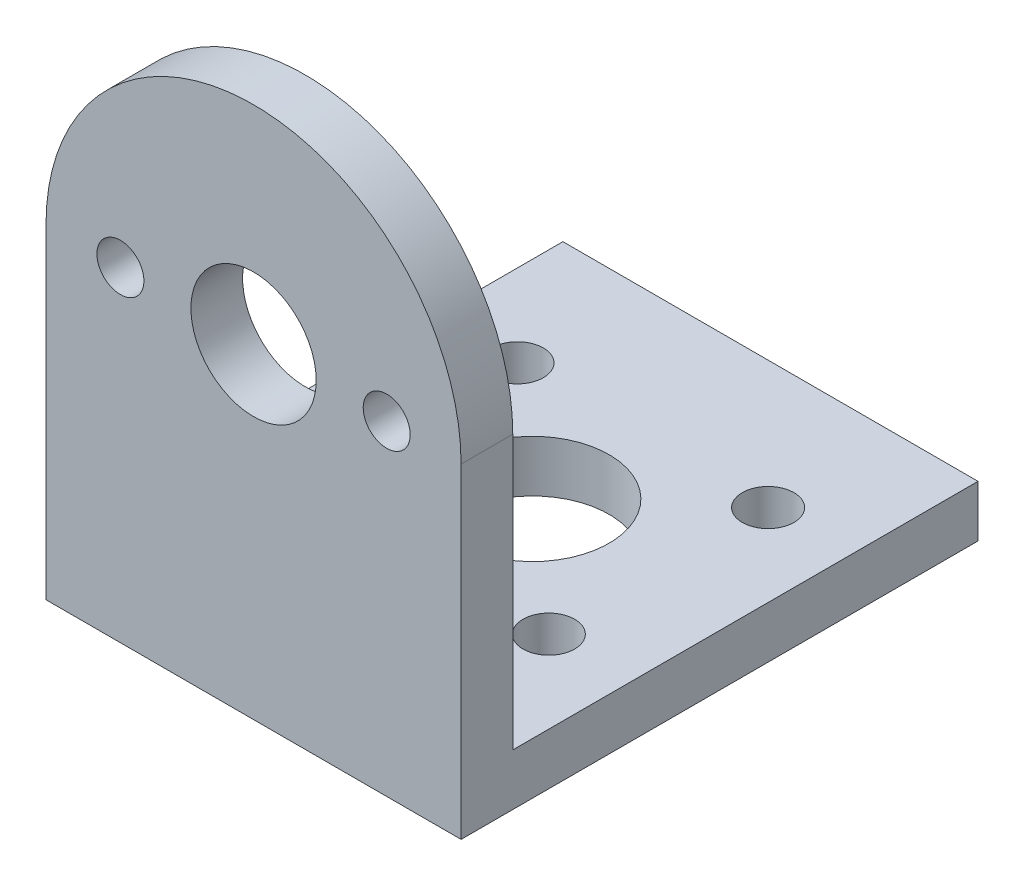
ISO-10303-21;
HEADER;
FILE_DESCRIPTION(('STEP AP214'),'2;1');
FILE_NAME('part.step','',(''),(''),'','','');
FILE_SCHEMA(('AUTOMOTIVE_DESIGN { 1 0 10303 214 1 1 1 1 }'));
ENDSEC;
DATA;
#1=APPLICATION_CONTEXT('core data for automotive mechanical design processes');
#2=APPLICATION_PROTOCOL_DEFINITION('international standard','automotive_design',2000,#1);
#3=PRODUCT_CONTEXT('',#1,'mechanical');
#4=PRODUCT('Part','Part','',(#3));
#5=PRODUCT_RELATED_PRODUCT_CATEGORY('part','',(#4));
#6=PRODUCT_DEFINITION_FORMATION('','',#4);
#7=PRODUCT_DEFINITION_CONTEXT('part definition',#1,'design');
#8=PRODUCT_DEFINITION('design','',#6,#7);
#9=PRODUCT_DEFINITION_SHAPE('','',#8);
#10=(LENGTH_UNIT() NAMED_UNIT(*) SI_UNIT(.MILLI.,.METRE.));
#11=(NAMED_UNIT(*) PLANE_ANGLE_UNIT() SI_UNIT($,.RADIAN.));
#12=(NAMED_UNIT(*) SI_UNIT($,.STERADIAN.) SOLID_ANGLE_UNIT());
#13=UNCERTAINTY_MEASURE_WITH_UNIT(LENGTH_MEASURE(1.E-05),#10,'distance_accuracy_value','');
#14=(GEOMETRIC_REPRESENTATION_CONTEXT(3) GLOBAL_UNCERTAINTY_ASSIGNED_CONTEXT((#13)) GLOBAL_UNIT_ASSIGNED_CONTEXT((#10,
#11,#12)) REPRESENTATION_CONTEXT('',''));
#15=CARTESIAN_POINT('',(0.,0.,0.));
#16=DIRECTION('',(0.,0.,1.));
#17=DIRECTION('',(1.,0.,0.));
#18=AXIS2_PLACEMENT_3D('',#15,#16,#17);
#19=CARTESIAN_POINT('',(0.,0.,0.));
#20=DIRECTION('',(0.,0.,-1.));
#21=DIRECTION('',(-1.,0.,0.));
#22=AXIS2_PLACEMENT_3D('',#19,#20,#21);
#23=PLANE('',#22);
#24=CARTESIAN_POINT('',(-8.5,0.,0.));
#25=DIRECTION('',(0.,0.,1.));
#26=DIRECTION('',(1.,0.,0.));
#27=AXIS2_PLACEMENT_3D('',#24,#25,#26);
#28=CIRCLE('',#27,1.5);
#29=CARTESIAN_POINT('',(-7.,0.,0.));
#30=VERTEX_POINT('',#29);
#31=EDGE_CURVE('E129',#30,#30,#28,.T.);
#32=ORIENTED_EDGE('',*,*,#31,.T.);
#33=EDGE_LOOP('',(#32));
#34=FACE_BOUND('',#33,.T.);
#35=CARTESIAN_POINT('',(0.,0.,0.));
#36=DIRECTION('',(0.,0.,1.));
#37=DIRECTION('',(1.,0.,0.));
#38=AXIS2_PLACEMENT_3D('',#35,#36,#37);
#39=CIRCLE('',#38,4.);
#40=CARTESIAN_POINT('',(4.,0.,0.));
#41=VERTEX_POINT('',#40);
#42=EDGE_CURVE('E135',#41,#41,#39,.T.);
#43=ORIENTED_EDGE('',*,*,#42,.T.);
#44=EDGE_LOOP('',(#43));
#45=FACE_BOUND('',#44,.T.);
#46=CARTESIAN_POINT('',(8.5,0.,0.));
#47=DIRECTION('',(0.,0.,1.));
#48=DIRECTION('',(-1.,0.,0.));
#49=AXIS2_PLACEMENT_3D('',#46,#47,#48);
#50=CIRCLE('',#49,1.5);
#51=CARTESIAN_POINT('',(7.,0.,0.));
#52=VERTEX_POINT('',#51);
#53=EDGE_CURVE('E124',#52,#52,#50,.T.);
#54=ORIENTED_EDGE('',*,*,#53,.T.);
#55=EDGE_LOOP('',(#54));
#56=FACE_BOUND('',#55,.T.);
#57=DIRECTION('',(0.,1.,0.));
#58=VECTOR('',#57,1.);
#59=CARTESIAN_POINT('',(13.25,0.,0.));
#60=LINE('',#59,#58);
#61=CARTESIAN_POINT('',(13.25,-17.45,0.));
#62=VERTEX_POINT('',#61);
#63=CARTESIAN_POINT('',(13.25,0.,0.));
#64=VERTEX_POINT('',#63);
#65=EDGE_CURVE('E75',#62,#64,#60,.T.);
#66=ORIENTED_EDGE('',*,*,#65,.F.);
#67=DIRECTION('',(-1.,0.,0.));
#68=VECTOR('',#67,1.);
#69=CARTESIAN_POINT('',(13.25,-17.45,0.));
#70=LINE('',#69,#68);
#71=CARTESIAN_POINT('',(-13.25,-17.45,0.));
#72=VERTEX_POINT('',#71);
#73=EDGE_CURVE('E99',#62,#72,#70,.T.);
#74=ORIENTED_EDGE('',*,*,#73,.T.);
#75=DIRECTION('',(0.,-1.,0.));
#76=VECTOR('',#75,1.);
#77=CARTESIAN_POINT('',(-13.25,0.,0.));
#78=LINE('',#77,#76);
#79=CARTESIAN_POINT('',(-13.25,0.,0.));
#80=VERTEX_POINT('',#79);
#81=EDGE_CURVE('E153',#80,#72,#78,.T.);
#82=ORIENTED_EDGE('',*,*,#81,.F.);
#83=CARTESIAN_POINT('',(0.,0.,0.));
#84=DIRECTION('',(0.,0.,1.));
#85=DIRECTION('',(-1.,0.,0.));
#86=AXIS2_PLACEMENT_3D('',#83,#84,#85);
#87=CIRCLE('',#86,13.25);
#88=EDGE_CURVE('E141',#64,#80,#87,.T.);
#89=ORIENTED_EDGE('',*,*,#88,.F.);
#90=EDGE_LOOP('',(#66,#74,#82,#89));
#91=FACE_BOUND('',#90,.T.);
#92=ADVANCED_FACE('F36',(#34,#45,#56,#91),#23,.T.);
#93=CARTESIAN_POINT('',(0.,0.,3.3));
#94=DIRECTION('',(0.,0.,-1.));
#95=DIRECTION('',(-1.,0.,0.));
#96=AXIS2_PLACEMENT_3D('',#93,#94,#95);
#97=PLANE('',#96);
#98=CARTESIAN_POINT('',(0.,0.,3.3));
#99=DIRECTION('',(0.,0.,1.));
#100=DIRECTION('',(-1.,0.,0.));
#101=AXIS2_PLACEMENT_3D('',#98,#99,#100);
#102=CIRCLE('',#101,13.25);
#103=CARTESIAN_POINT('',(13.25,0.,3.3));
#104=VERTEX_POINT('',#103);
#105=CARTESIAN_POINT('',(-13.25,0.,3.3));
#106=VERTEX_POINT('',#105);
#107=EDGE_CURVE('E144',#104,#106,#102,.T.);
#108=ORIENTED_EDGE('',*,*,#107,.T.);
#109=DIRECTION('',(0.,-1.,0.));
#110=VECTOR('',#109,1.);
#111=CARTESIAN_POINT('',(-13.25,0.,3.3));
#112=LINE('',#111,#110);
#113=CARTESIAN_POINT('',(-13.25,-20.75,3.3));
#114=VERTEX_POINT('',#113);
#115=EDGE_CURVE('E82',#106,#114,#112,.T.);
#116=ORIENTED_EDGE('',*,*,#115,.T.);
#117=DIRECTION('',(1.,0.,0.));
#118=VECTOR('',#117,1.);
#119=CARTESIAN_POINT('',(-13.25,-20.75,3.3));
#120=LINE('',#119,#118);
#121=CARTESIAN_POINT('',(13.25,-20.75,3.3));
#122=VERTEX_POINT('',#121);
#123=EDGE_CURVE('E147',#114,#122,#120,.T.);
#124=ORIENTED_EDGE('',*,*,#123,.T.);
#125=DIRECTION('',(0.,1.,0.));
#126=VECTOR('',#125,1.);
#127=CARTESIAN_POINT('',(13.25,0.,3.3));
#128=LINE('',#127,#126);
#129=EDGE_CURVE('E60',#122,#104,#128,.T.);
#130=ORIENTED_EDGE('',*,*,#129,.T.);
#131=EDGE_LOOP('',(#108,#116,#124,#130));
#132=FACE_BOUND('',#131,.T.);
#133=CARTESIAN_POINT('',(0.,0.,3.3));
#134=DIRECTION('',(0.,0.,1.));
#135=DIRECTION('',(1.,0.,0.));
#136=AXIS2_PLACEMENT_3D('',#133,#134,#135);
#137=CIRCLE('',#136,4.);
#138=CARTESIAN_POINT('',(4.,0.,3.3));
#139=VERTEX_POINT('',#138);
#140=EDGE_CURVE('E138',#139,#139,#137,.T.);
#141=ORIENTED_EDGE('',*,*,#140,.F.);
#142=EDGE_LOOP('',(#141));
#143=FACE_BOUND('',#142,.T.);
#144=CARTESIAN_POINT('',(-8.5,0.,3.3));
#145=DIRECTION('',(0.,0.,1.));
#146=DIRECTION('',(1.,0.,0.));
#147=AXIS2_PLACEMENT_3D('',#144,#145,#146);
#148=CIRCLE('',#147,1.5);
#149=CARTESIAN_POINT('',(-7.,0.,3.3));
#150=VERTEX_POINT('',#149);
#151=EDGE_CURVE('E132',#150,#150,#148,.T.);
#152=ORIENTED_EDGE('',*,*,#151,.F.);
#153=EDGE_LOOP('',(#152));
#154=FACE_BOUND('',#153,.T.);
#155=CARTESIAN_POINT('',(8.5,0.,3.3));
#156=DIRECTION('',(0.,0.,1.));
#157=DIRECTION('',(-1.,0.,0.));
#158=AXIS2_PLACEMENT_3D('',#155,#156,#157);
#159=CIRCLE('',#158,1.5);
#160=CARTESIAN_POINT('',(7.,0.,3.3));
#161=VERTEX_POINT('',#160);
#162=EDGE_CURVE('E126',#161,#161,#159,.T.);
#163=ORIENTED_EDGE('',*,*,#162,.F.);
#164=EDGE_LOOP('',(#163));
#165=FACE_BOUND('',#164,.T.);
#166=ADVANCED_FACE('F167',(#132,#143,#154,#165),#97,.F.);
#167=CARTESIAN_POINT('',(0.,0.,3.3));
#168=DIRECTION('',(0.,0.,-1.));
#169=DIRECTION('',(-1.,0.,0.));
#170=AXIS2_PLACEMENT_3D('',#167,#168,#169);
#171=CYLINDRICAL_SURFACE('',#170,13.25);
#172=ORIENTED_EDGE('',*,*,#88,.T.);
#173=DIRECTION('',(0.,0.,-1.));
#174=VECTOR('',#173,1.);
#175=CARTESIAN_POINT('',(-13.25,0.,3.3));
#176=LINE('',#175,#174);
#177=EDGE_CURVE('E11',#106,#80,#176,.T.);
#178=ORIENTED_EDGE('',*,*,#177,.F.);
#179=ORIENTED_EDGE('',*,*,#107,.F.);
#180=DIRECTION('',(0.,0.,-1.));
#181=VECTOR('',#180,1.);
#182=CARTESIAN_POINT('',(13.25,0.,3.3));
#183=LINE('',#182,#181);
#184=EDGE_CURVE('E150',#104,#64,#183,.T.);
#185=ORIENTED_EDGE('',*,*,#184,.T.);
#186=EDGE_LOOP('',(#172,#178,#179,#185));
#187=FACE_BOUND('',#186,.T.);
#188=ADVANCED_FACE('F38',(#187),#171,.T.);
#189=CARTESIAN_POINT('',(-13.25,0.,3.3));
#190=DIRECTION('',(1.,0.,0.));
#191=DIRECTION('',(0.,1.,0.));
#192=AXIS2_PLACEMENT_3D('',#189,#190,#191);
#193=PLANE('',#192);
#194=ORIENTED_EDGE('',*,*,#81,.T.);
#195=DIRECTION('',(0.,0.,1.));
#196=VECTOR('',#195,1.);
#197=CARTESIAN_POINT('',(-13.25,-17.45,-29.7));
#198=LINE('',#197,#196);
#199=CARTESIAN_POINT('',(-13.25,-17.45,-29.7));
#200=VERTEX_POINT('',#199);
#201=EDGE_CURVE('E51',#200,#72,#198,.T.);
#202=ORIENTED_EDGE('',*,*,#201,.F.);
#203=DIRECTION('',(0.,-1.,0.));
#204=VECTOR('',#203,1.);
#205=CARTESIAN_POINT('',(-13.25,-20.75,-29.7));
#206=LINE('',#205,#204);
#207=CARTESIAN_POINT('',(-13.25,-20.75,-29.7));
#208=VERTEX_POINT('',#207);
#209=EDGE_CURVE('E111',#200,#208,#206,.T.);
#210=ORIENTED_EDGE('',*,*,#209,.T.);
#211=DIRECTION('',(0.,0.,-1.));
#212=VECTOR('',#211,1.);
#213=CARTESIAN_POINT('',(-13.25,-20.75,3.3));
#214=LINE('',#213,#212);
#215=EDGE_CURVE('E44',#114,#208,#214,.T.);
#216=ORIENTED_EDGE('',*,*,#215,.F.);
#217=ORIENTED_EDGE('',*,*,#115,.F.);
#218=ORIENTED_EDGE('',*,*,#177,.T.);
#219=EDGE_LOOP('',(#194,#202,#210,#216,#217,#218));
#220=FACE_BOUND('',#219,.T.);
#221=ADVANCED_FACE('F161',(#220),#193,.F.);
#222=CARTESIAN_POINT('',(-13.25,-20.75,3.3));
#223=DIRECTION('',(0.,1.,0.));
#224=DIRECTION('',(0.,0.,1.));
#225=AXIS2_PLACEMENT_3D('',#222,#223,#224);
#226=PLANE('',#225);
#227=CARTESIAN_POINT('',(8.,-20.75,-21.55));
#228=DIRECTION('',(0.,1.,0.));
#229=DIRECTION('',(0.,0.,1.));
#230=AXIS2_PLACEMENT_3D('',#227,#228,#229);
#231=CIRCLE('',#230,1.65);
#232=CARTESIAN_POINT('',(8.,-20.75,-19.9));
#233=VERTEX_POINT('',#232);
#234=EDGE_CURVE('E332',#233,#233,#231,.F.);
#235=ORIENTED_EDGE('',*,*,#234,.F.);
#236=EDGE_LOOP('',(#235));
#237=FACE_BOUND('',#236,.T.);
#238=CARTESIAN_POINT('',(8.,-20.75,-7.55));
#239=DIRECTION('',(0.,1.,0.));
#240=DIRECTION('',(0.,0.,1.));
#241=AXIS2_PLACEMENT_3D('',#238,#239,#240);
#242=CIRCLE('',#241,1.65);
#243=CARTESIAN_POINT('',(8.,-20.75,-5.9));
#244=VERTEX_POINT('',#243);
#245=EDGE_CURVE('E340',#244,#244,#242,.F.);
#246=ORIENTED_EDGE('',*,*,#245,.F.);
#247=EDGE_LOOP('',(#246));
#248=FACE_BOUND('',#247,.T.);
#249=CARTESIAN_POINT('',(-7.99999999999999,-20.75,-7.55));
#250=DIRECTION('',(0.,1.,0.));
#251=DIRECTION('',(0.,0.,1.));
#252=AXIS2_PLACEMENT_3D('',#249,#250,#251);
#253=CIRCLE('',#252,1.65);
#254=CARTESIAN_POINT('',(-7.99999999999999,-20.75,-5.9));
#255=VERTEX_POINT('',#254);
#256=EDGE_CURVE('E353',#255,#255,#253,.F.);
#257=ORIENTED_EDGE('',*,*,#256,.F.);
#258=EDGE_LOOP('',(#257));
#259=FACE_BOUND('',#258,.T.);
#260=CARTESIAN_POINT('',(-8.,-20.75,-21.55));
#261=DIRECTION('',(0.,1.,0.));
#262=DIRECTION('',(0.,0.,1.));
#263=AXIS2_PLACEMENT_3D('',#260,#261,#262);
#264=CIRCLE('',#263,1.65);
#265=CARTESIAN_POINT('',(-8.,-20.75,-19.9));
#266=VERTEX_POINT('',#265);
#267=EDGE_CURVE('E344',#266,#266,#264,.F.);
#268=ORIENTED_EDGE('',*,*,#267,.F.);
#269=EDGE_LOOP('',(#268));
#270=FACE_BOUND('',#269,.T.);
#271=CARTESIAN_POINT('',(0.,-20.75,-14.5));
#272=DIRECTION('',(0.,1.,0.));
#273=DIRECTION('',(0.,0.,1.));
#274=AXIS2_PLACEMENT_3D('',#271,#272,#273);
#275=CIRCLE('',#274,4.9);
#276=CARTESIAN_POINT('',(0.,-20.75,-9.6));
#277=VERTEX_POINT('',#276);
#278=EDGE_CURVE('E117',#277,#277,#275,.F.);
#279=ORIENTED_EDGE('',*,*,#278,.F.);
#280=EDGE_LOOP('',(#279));
#281=FACE_BOUND('',#280,.T.);
#282=ORIENTED_EDGE('',*,*,#215,.T.);
#283=DIRECTION('',(1.,0.,0.));
#284=VECTOR('',#283,1.);
#285=CARTESIAN_POINT('',(13.25,-20.75,-29.7));
#286=LINE('',#285,#284);
#287=CARTESIAN_POINT('',(13.25,-20.75,-29.7));
#288=VERTEX_POINT('',#287);
#289=EDGE_CURVE('E101',#208,#288,#286,.T.);
#290=ORIENTED_EDGE('',*,*,#289,.T.);
#291=DIRECTION('',(0.,0.,-1.));
#292=VECTOR('',#291,1.);
#293=CARTESIAN_POINT('',(13.25,-20.75,3.3));
#294=LINE('',#293,#292);
#295=EDGE_CURVE('E115',#122,#288,#294,.T.);
#296=ORIENTED_EDGE('',*,*,#295,.F.);
#297=ORIENTED_EDGE('',*,*,#123,.F.);
#298=EDGE_LOOP('',(#282,#290,#296,#297));
#299=FACE_BOUND('',#298,.T.);
#300=ADVANCED_FACE('F160',(#237,#248,#259,#270,#281,#299),#226,.F.);
#301=CARTESIAN_POINT('',(13.25,0.,3.3));
#302=DIRECTION('',(-1.,0.,0.));
#303=DIRECTION('',(0.,-1.,0.));
#304=AXIS2_PLACEMENT_3D('',#301,#302,#303);
#305=PLANE('',#304);
#306=ORIENTED_EDGE('',*,*,#295,.T.);
#307=DIRECTION('',(0.,1.,0.));
#308=VECTOR('',#307,1.);
#309=CARTESIAN_POINT('',(13.25,-20.75,-29.7));
#310=LINE('',#309,#308);
#311=CARTESIAN_POINT('',(13.25,-17.45,-29.7));
#312=VERTEX_POINT('',#311);
#313=EDGE_CURVE('E108',#288,#312,#310,.T.);
#314=ORIENTED_EDGE('',*,*,#313,.T.);
#315=DIRECTION('',(0.,0.,1.));
#316=VECTOR('',#315,1.);
#317=CARTESIAN_POINT('',(13.25,-17.45,-29.7));
#318=LINE('',#317,#316);
#319=EDGE_CURVE('E95',#312,#62,#318,.T.);
#320=ORIENTED_EDGE('',*,*,#319,.T.);
#321=ORIENTED_EDGE('',*,*,#65,.T.);
#322=ORIENTED_EDGE('',*,*,#184,.F.);
#323=ORIENTED_EDGE('',*,*,#129,.F.);
#324=EDGE_LOOP('',(#306,#314,#320,#321,#322,#323));
#325=FACE_BOUND('',#324,.T.);
#326=ADVANCED_FACE('F113',(#325),#305,.F.);
#327=CARTESIAN_POINT('',(0.,0.,3.3));
#328=DIRECTION('',(0.,0.,-1.));
#329=DIRECTION('',(-1.,0.,0.));
#330=AXIS2_PLACEMENT_3D('',#327,#328,#329);
#331=CYLINDRICAL_SURFACE('',#330,4.);
#332=ORIENTED_EDGE('',*,*,#140,.T.);
#333=EDGE_LOOP('',(#332));
#334=FACE_BOUND('',#333,.T.);
#335=ORIENTED_EDGE('',*,*,#42,.F.);
#336=EDGE_LOOP('',(#335));
#337=FACE_BOUND('',#336,.T.);
#338=ADVANCED_FACE('F194',(#334,#337),#331,.F.);
#339=CARTESIAN_POINT('',(-8.5,0.,3.3));
#340=DIRECTION('',(0.,0.,-1.));
#341=DIRECTION('',(-1.,0.,0.));
#342=AXIS2_PLACEMENT_3D('',#339,#340,#341);
#343=CYLINDRICAL_SURFACE('',#342,1.5);
#344=ORIENTED_EDGE('',*,*,#151,.T.);
#345=EDGE_LOOP('',(#344));
#346=FACE_BOUND('',#345,.T.);
#347=ORIENTED_EDGE('',*,*,#31,.F.);
#348=EDGE_LOOP('',(#347));
#349=FACE_BOUND('',#348,.T.);
#350=ADVANCED_FACE('F180',(#346,#349),#343,.F.);
#351=CARTESIAN_POINT('',(8.5,0.,3.3));
#352=DIRECTION('',(0.,0.,-1.));
#353=DIRECTION('',(-1.,0.,0.));
#354=AXIS2_PLACEMENT_3D('',#351,#352,#353);
#355=CYLINDRICAL_SURFACE('',#354,1.5);
#356=ORIENTED_EDGE('',*,*,#162,.T.);
#357=EDGE_LOOP('',(#356));
#358=FACE_BOUND('',#357,.T.);
#359=ORIENTED_EDGE('',*,*,#53,.F.);
#360=EDGE_LOOP('',(#359));
#361=FACE_BOUND('',#360,.T.);
#362=ADVANCED_FACE('F177',(#358,#361),#355,.F.);
#363=CARTESIAN_POINT('',(13.25,-17.45,-29.7));
#364=DIRECTION('',(0.,1.,0.));
#365=DIRECTION('',(-1.,0.,0.));
#366=AXIS2_PLACEMENT_3D('',#363,#364,#365);
#367=PLANE('',#366);
#368=CARTESIAN_POINT('',(8.,-17.45,-21.55));
#369=DIRECTION('',(0.,1.,0.));
#370=DIRECTION('',(1.,0.,0.));
#371=AXIS2_PLACEMENT_3D('',#368,#369,#370);
#372=CIRCLE('',#371,1.65);
#373=CARTESIAN_POINT('',(9.65,-17.45,-21.55));
#374=VERTEX_POINT('',#373);
#375=EDGE_CURVE('E335',#374,#374,#372,.T.);
#376=ORIENTED_EDGE('',*,*,#375,.F.);
#377=EDGE_LOOP('',(#376));
#378=FACE_BOUND('',#377,.T.);
#379=CARTESIAN_POINT('',(8.,-17.45,-7.55));
#380=DIRECTION('',(0.,1.,0.));
#381=DIRECTION('',(1.,0.,0.));
#382=AXIS2_PLACEMENT_3D('',#379,#380,#381);
#383=CIRCLE('',#382,1.65);
#384=CARTESIAN_POINT('',(9.65,-17.45,-7.55));
#385=VERTEX_POINT('',#384);
#386=EDGE_CURVE('E337',#385,#385,#383,.T.);
#387=ORIENTED_EDGE('',*,*,#386,.F.);
#388=EDGE_LOOP('',(#387));
#389=FACE_BOUND('',#388,.T.);
#390=CARTESIAN_POINT('',(-7.99999999999999,-17.45,-7.55));
#391=DIRECTION('',(0.,1.,0.));
#392=DIRECTION('',(-1.,0.,0.));
#393=AXIS2_PLACEMENT_3D('',#390,#391,#392);
#394=CIRCLE('',#393,1.65);
#395=CARTESIAN_POINT('',(-9.65,-17.45,-7.55));
#396=VERTEX_POINT('',#395);
#397=EDGE_CURVE('E356',#396,#396,#394,.T.);
#398=ORIENTED_EDGE('',*,*,#397,.F.);
#399=EDGE_LOOP('',(#398));
#400=FACE_BOUND('',#399,.T.);
#401=CARTESIAN_POINT('',(-8.,-17.45,-21.55));
#402=DIRECTION('',(0.,1.,0.));
#403=DIRECTION('',(-1.,0.,0.));
#404=AXIS2_PLACEMENT_3D('',#401,#402,#403);
#405=CIRCLE('',#404,1.65);
#406=CARTESIAN_POINT('',(-9.65,-17.45,-21.55));
#407=VERTEX_POINT('',#406);
#408=EDGE_CURVE('E349',#407,#407,#405,.T.);
#409=ORIENTED_EDGE('',*,*,#408,.F.);
#410=EDGE_LOOP('',(#409));
#411=FACE_BOUND('',#410,.T.);
#412=CARTESIAN_POINT('',(0.,-17.45,-14.5));
#413=DIRECTION('',(0.,1.,0.));
#414=DIRECTION('',(-1.,0.,0.));
#415=AXIS2_PLACEMENT_3D('',#412,#413,#414);
#416=CIRCLE('',#415,4.9);
#417=CARTESIAN_POINT('',(-4.9,-17.45,-14.5));
#418=VERTEX_POINT('',#417);
#419=EDGE_CURVE('E342',#418,#418,#416,.T.);
#420=ORIENTED_EDGE('',*,*,#419,.F.);
#421=EDGE_LOOP('',(#420));
#422=FACE_BOUND('',#421,.T.);
#423=ORIENTED_EDGE('',*,*,#73,.F.);
#424=ORIENTED_EDGE('',*,*,#319,.F.);
#425=DIRECTION('',(-1.,0.,0.));
#426=VECTOR('',#425,1.);
#427=CARTESIAN_POINT('',(13.25,-17.45,-29.7));
#428=LINE('',#427,#426);
#429=EDGE_CURVE('E98',#312,#200,#428,.T.);
#430=ORIENTED_EDGE('',*,*,#429,.T.);
#431=ORIENTED_EDGE('',*,*,#201,.T.);
#432=EDGE_LOOP('',(#423,#424,#430,#431));
#433=FACE_BOUND('',#432,.T.);
#434=ADVANCED_FACE('F97',(#378,#389,#400,#411,#422,#433),#367,.T.);
#435=CARTESIAN_POINT('',(0.,0.,-29.7));
#436=DIRECTION('',(0.,0.,1.));
#437=DIRECTION('',(1.,0.,0.));
#438=AXIS2_PLACEMENT_3D('',#435,#436,#437);
#439=PLANE('',#438);
#440=ORIENTED_EDGE('',*,*,#313,.F.);
#441=ORIENTED_EDGE('',*,*,#289,.F.);
#442=ORIENTED_EDGE('',*,*,#209,.F.);
#443=ORIENTED_EDGE('',*,*,#429,.F.);
#444=EDGE_LOOP('',(#440,#441,#442,#443));
#445=FACE_BOUND('',#444,.T.);
#446=ADVANCED_FACE('F106',(#445),#439,.F.);
#447=CARTESIAN_POINT('',(0.,-34.6092929112563,-14.5));
#448=DIRECTION('',(0.,1.,0.));
#449=DIRECTION('',(-1.,0.,0.));
#450=AXIS2_PLACEMENT_3D('',#447,#448,#449);
#451=CYLINDRICAL_SURFACE('',#450,4.9);
#452=ORIENTED_EDGE('',*,*,#278,.T.);
#453=EDGE_LOOP('',(#452));
#454=FACE_BOUND('',#453,.T.);
#455=ORIENTED_EDGE('',*,*,#419,.T.);
#456=EDGE_LOOP('',(#455));
#457=FACE_BOUND('',#456,.T.);
#458=ADVANCED_FACE('F265',(#454,#457),#451,.F.);
#459=CARTESIAN_POINT('',(-7.99999999999999,-34.6092929112563,-21.55));
#460=DIRECTION('',(0.,1.,0.));
#461=DIRECTION('',(-1.,0.,0.));
#462=AXIS2_PLACEMENT_3D('',#459,#460,#461);
#463=CYLINDRICAL_SURFACE('',#462,1.65);
#464=ORIENTED_EDGE('',*,*,#267,.T.);
#465=EDGE_LOOP('',(#464));
#466=FACE_BOUND('',#465,.T.);
#467=ORIENTED_EDGE('',*,*,#408,.T.);
#468=EDGE_LOOP('',(#467));
#469=FACE_BOUND('',#468,.T.);
#470=ADVANCED_FACE('F285',(#466,#469),#463,.F.);
#471=CARTESIAN_POINT('',(-7.99999999999999,-34.6092929112563,-7.55));
#472=DIRECTION('',(0.,1.,0.));
#473=DIRECTION('',(-1.,0.,0.));
#474=AXIS2_PLACEMENT_3D('',#471,#472,#473);
#475=CYLINDRICAL_SURFACE('',#474,1.65);
#476=ORIENTED_EDGE('',*,*,#256,.T.);
#477=EDGE_LOOP('',(#476));
#478=FACE_BOUND('',#477,.T.);
#479=ORIENTED_EDGE('',*,*,#397,.T.);
#480=EDGE_LOOP('',(#479));
#481=FACE_BOUND('',#480,.T.);
#482=ADVANCED_FACE('F295',(#478,#481),#475,.F.);
#483=CARTESIAN_POINT('',(8.,-34.6092929112563,-7.55));
#484=DIRECTION('',(0.,1.,0.));
#485=DIRECTION('',(-1.,0.,0.));
#486=AXIS2_PLACEMENT_3D('',#483,#484,#485);
#487=CYLINDRICAL_SURFACE('',#486,1.65);
#488=ORIENTED_EDGE('',*,*,#245,.T.);
#489=EDGE_LOOP('',(#488));
#490=FACE_BOUND('',#489,.T.);
#491=ORIENTED_EDGE('',*,*,#386,.T.);
#492=EDGE_LOOP('',(#491));
#493=FACE_BOUND('',#492,.T.);
#494=ADVANCED_FACE('F305',(#490,#493),#487,.F.);
#495=CARTESIAN_POINT('',(8.,-34.6092929112563,-21.55));
#496=DIRECTION('',(0.,1.,0.));
#497=DIRECTION('',(-1.,0.,0.));
#498=AXIS2_PLACEMENT_3D('',#495,#496,#497);
#499=CYLINDRICAL_SURFACE('',#498,1.65);
#500=ORIENTED_EDGE('',*,*,#234,.T.);
#501=EDGE_LOOP('',(#500));
#502=FACE_BOUND('',#501,.T.);
#503=ORIENTED_EDGE('',*,*,#375,.T.);
#504=EDGE_LOOP('',(#503));
#505=FACE_BOUND('',#504,.T.);
#506=ADVANCED_FACE('F315',(#502,#505),#499,.F.);
#507=CLOSED_SHELL('',(#92,#166,#188,#221,#300,#326,#338,#350,#362,#434,#446,#458,#470,#482,#494,#506));
#508=MANIFOLD_SOLID_BREP('B2',#507);
#509=ADVANCED_BREP_SHAPE_REPRESENTATION('',(#18,#508),#14);
#510=SHAPE_DEFINITION_REPRESENTATION(#9,#509);
ENDSEC;
END-ISO-10303-21;
